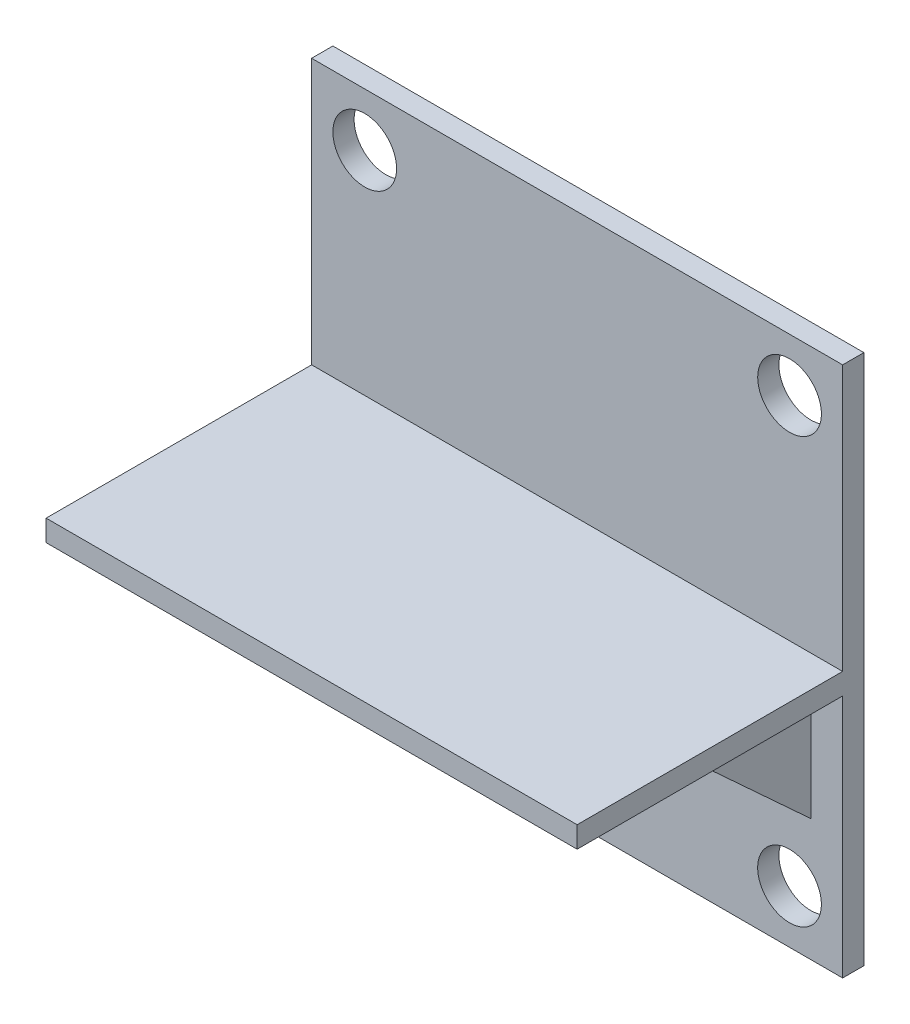
ISO-10303-21;
HEADER;
FILE_DESCRIPTION(('STEP AP214'),'2;1');
FILE_NAME('part.step','',(''),(''),'','','');
FILE_SCHEMA(('AUTOMOTIVE_DESIGN { 1 0 10303 214 1 1 1 1 }'));
ENDSEC;
DATA;
#1=APPLICATION_CONTEXT('core data for automotive mechanical design processes');
#2=APPLICATION_PROTOCOL_DEFINITION('international standard','automotive_design',2000,#1);
#3=PRODUCT_CONTEXT('',#1,'mechanical');
#4=PRODUCT('Part','Part','',(#3));
#5=PRODUCT_RELATED_PRODUCT_CATEGORY('part','',(#4));
#6=PRODUCT_DEFINITION_FORMATION('','',#4);
#7=PRODUCT_DEFINITION_CONTEXT('part definition',#1,'design');
#8=PRODUCT_DEFINITION('design','',#6,#7);
#9=PRODUCT_DEFINITION_SHAPE('','',#8);
#10=(LENGTH_UNIT() NAMED_UNIT(*) SI_UNIT(.MILLI.,.METRE.));
#11=(NAMED_UNIT(*) PLANE_ANGLE_UNIT() SI_UNIT($,.RADIAN.));
#12=(NAMED_UNIT(*) SI_UNIT($,.STERADIAN.) SOLID_ANGLE_UNIT());
#13=UNCERTAINTY_MEASURE_WITH_UNIT(LENGTH_MEASURE(1.E-05),#10,'distance_accuracy_value','');
#14=(GEOMETRIC_REPRESENTATION_CONTEXT(3) GLOBAL_UNCERTAINTY_ASSIGNED_CONTEXT((#13)) GLOBAL_UNIT_ASSIGNED_CONTEXT((#10,
#11,#12)) REPRESENTATION_CONTEXT('',''));
#15=CARTESIAN_POINT('',(0.,0.,0.));
#16=DIRECTION('',(0.,0.,1.));
#17=DIRECTION('',(1.,0.,0.));
#18=AXIS2_PLACEMENT_3D('',#15,#16,#17);
#19=CARTESIAN_POINT('',(0.,0.,10.));
#20=DIRECTION('',(0.,0.,1.));
#21=DIRECTION('',(1.,0.,0.));
#22=AXIS2_PLACEMENT_3D('',#19,#20,#21);
#23=PLANE('',#22);
#24=CARTESIAN_POINT('',(-71.100042531515,-124.872643547367,10.));
#25=DIRECTION('',(0.,0.,1.));
#26=DIRECTION('',(-1.,0.,0.));
#27=AXIS2_PLACEMENT_3D('',#24,#25,#26);
#28=CIRCLE('',#27,15.);
#29=CARTESIAN_POINT('',(-86.100042531515,-124.872643547367,10.));
#30=VERTEX_POINT('',#29);
#31=EDGE_CURVE('E196',#30,#30,#28,.T.);
#32=ORIENTED_EDGE('',*,*,#31,.F.);
#33=EDGE_LOOP('',(#32));
#34=FACE_BOUND('',#33,.T.);
#35=CARTESIAN_POINT('',(128.899957468485,-124.872643547367,10.));
#36=DIRECTION('',(0.,0.,1.));
#37=DIRECTION('',(1.,0.,0.));
#38=AXIS2_PLACEMENT_3D('',#35,#36,#37);
#39=CIRCLE('',#38,15.);
#40=CARTESIAN_POINT('',(143.899957468485,-124.872643547367,10.));
#41=VERTEX_POINT('',#40);
#42=EDGE_CURVE('E205',#41,#41,#39,.T.);
#43=ORIENTED_EDGE('',*,*,#42,.F.);
#44=EDGE_LOOP('',(#43));
#45=FACE_BOUND('',#44,.T.);
#46=DIRECTION('',(-1.,0.,0.));
#47=VECTOR('',#46,1.);
#48=CARTESIAN_POINT('',(153.899957468485,-34.8726435473666,10.));
#49=LINE('',#48,#47);
#50=CARTESIAN_POINT('',(128.899957468485,-34.8726435473666,10.));
#51=VERTEX_POINT('',#50);
#52=CARTESIAN_POINT('',(38.899957468485,-34.8726435473666,10.));
#53=VERTEX_POINT('',#52);
#54=EDGE_CURVE('E189',#51,#53,#49,.T.);
#55=ORIENTED_EDGE('',*,*,#54,.T.);
#56=DIRECTION('',(0.,-1.,0.));
#57=VECTOR('',#56,1.);
#58=CARTESIAN_POINT('',(38.899957468485,0.,10.));
#59=LINE('',#58,#57);
#60=CARTESIAN_POINT('',(38.899957468485,-95.8832277083029,10.));
#61=VERTEX_POINT('',#60);
#62=EDGE_CURVE('E482',#53,#61,#59,.T.);
#63=ORIENTED_EDGE('',*,*,#62,.T.);
#64=DIRECTION('',(-1.,0.,0.));
#65=VECTOR('',#64,1.);
#66=CARTESIAN_POINT('',(38.899957468485,-95.8832277083029,10.));
#67=LINE('',#66,#65);
#68=CARTESIAN_POINT('',(18.899957468485,-95.8832277083029,10.));
#69=VERTEX_POINT('',#68);
#70=EDGE_CURVE('E181',#61,#69,#67,.T.);
#71=ORIENTED_EDGE('',*,*,#70,.T.);
#72=DIRECTION('',(0.,-1.,0.));
#73=VECTOR('',#72,1.);
#74=CARTESIAN_POINT('',(18.899957468485,0.,10.));
#75=LINE('',#74,#73);
#76=CARTESIAN_POINT('',(18.899957468485,-34.8726435473666,10.));
#77=VERTEX_POINT('',#76);
#78=EDGE_CURVE('E170',#77,#69,#75,.T.);
#79=ORIENTED_EDGE('',*,*,#78,.F.);
#80=CARTESIAN_POINT('',(-71.100042531515,-34.8726435473666,10.));
#81=VERTEX_POINT('',#80);
#82=EDGE_CURVE('E178',#77,#81,#49,.T.);
#83=ORIENTED_EDGE('',*,*,#82,.T.);
#84=DIRECTION('',(0.,-1.,0.));
#85=VECTOR('',#84,1.);
#86=CARTESIAN_POINT('',(-71.100042531515,-92.3726435473666,10.));
#87=LINE('',#86,#85);
#88=CARTESIAN_POINT('',(-71.100042531515,-92.3726435473666,10.));
#89=VERTEX_POINT('',#88);
#90=EDGE_CURVE('E323',#81,#89,#87,.T.);
#91=ORIENTED_EDGE('',*,*,#90,.T.);
#92=DIRECTION('',(1.,0.,0.));
#93=VECTOR('',#92,1.);
#94=CARTESIAN_POINT('',(-81.100042531515,-92.3726435473666,10.));
#95=LINE('',#94,#93);
#96=CARTESIAN_POINT('',(-81.100042531515,-92.3726435473666,10.));
#97=VERTEX_POINT('',#96);
#98=EDGE_CURVE('E305',#97,#89,#95,.T.);
#99=ORIENTED_EDGE('',*,*,#98,.F.);
#100=DIRECTION('',(0.,-1.,0.));
#101=VECTOR('',#100,1.);
#102=CARTESIAN_POINT('',(-81.100042531515,-92.3726435473666,10.));
#103=LINE('',#102,#101);
#104=CARTESIAN_POINT('',(-81.100042531515,-34.8726435473666,10.));
#105=VERTEX_POINT('',#104);
#106=EDGE_CURVE('E310',#105,#97,#103,.T.);
#107=ORIENTED_EDGE('',*,*,#106,.F.);
#108=CARTESIAN_POINT('',(-96.100042531515,-34.8726435473666,10.));
#109=VERTEX_POINT('',#108);
#110=EDGE_CURVE('E190',#105,#109,#49,.T.);
#111=ORIENTED_EDGE('',*,*,#110,.T.);
#112=DIRECTION('',(0.,-1.,0.));
#113=VECTOR('',#112,1.);
#114=CARTESIAN_POINT('',(-96.100042531515,100.127356452633,10.));
#115=LINE('',#114,#113);
#116=CARTESIAN_POINT('',(-96.100042531515,-149.872643547367,10.));
#117=VERTEX_POINT('',#116);
#118=EDGE_CURVE('E230',#109,#117,#115,.T.);
#119=ORIENTED_EDGE('',*,*,#118,.T.);
#120=DIRECTION('',(1.,0.,0.));
#121=VECTOR('',#120,1.);
#122=CARTESIAN_POINT('',(-96.100042531515,-149.872643547367,10.));
#123=LINE('',#122,#121);
#124=CARTESIAN_POINT('',(153.899957468485,-149.872643547367,10.));
#125=VERTEX_POINT('',#124);
#126=EDGE_CURVE('E235',#117,#125,#123,.T.);
#127=ORIENTED_EDGE('',*,*,#126,.T.);
#128=DIRECTION('',(0.,1.,0.));
#129=VECTOR('',#128,1.);
#130=CARTESIAN_POINT('',(153.899957468485,-149.872643547367,10.));
#131=LINE('',#130,#129);
#132=CARTESIAN_POINT('',(153.899957468485,-34.8726435473666,10.));
#133=VERTEX_POINT('',#132);
#134=EDGE_CURVE('E238',#125,#133,#131,.T.);
#135=ORIENTED_EDGE('',*,*,#134,.T.);
#136=CARTESIAN_POINT('',(138.899957468485,-34.8726435473666,10.));
#137=VERTEX_POINT('',#136);
#138=EDGE_CURVE('E192',#133,#137,#49,.T.);
#139=ORIENTED_EDGE('',*,*,#138,.T.);
#140=DIRECTION('',(0.,-1.,0.));
#141=VECTOR('',#140,1.);
#142=CARTESIAN_POINT('',(138.899957468485,-92.3726435473666,10.));
#143=LINE('',#142,#141);
#144=CARTESIAN_POINT('',(138.899957468485,-92.3726435473666,10.));
#145=VERTEX_POINT('',#144);
#146=EDGE_CURVE('E58',#137,#145,#143,.T.);
#147=ORIENTED_EDGE('',*,*,#146,.T.);
#148=DIRECTION('',(-1.,0.,0.));
#149=VECTOR('',#148,1.);
#150=CARTESIAN_POINT('',(138.899957468485,-92.3726435473666,10.));
#151=LINE('',#150,#149);
#152=CARTESIAN_POINT('',(128.899957468485,-92.3726435473666,10.));
#153=VERTEX_POINT('',#152);
#154=EDGE_CURVE('E466',#145,#153,#151,.T.);
#155=ORIENTED_EDGE('',*,*,#154,.T.);
#156=DIRECTION('',(0.,-1.,0.));
#157=VECTOR('',#156,1.);
#158=CARTESIAN_POINT('',(128.899957468485,-92.3726435473666,10.));
#159=LINE('',#158,#157);
#160=EDGE_CURVE('E453',#51,#153,#159,.T.);
#161=ORIENTED_EDGE('',*,*,#160,.F.);
#162=EDGE_LOOP('',(#55,#63,#71,#79,#83,#91,#99,#107,#111,#119,#127,#135,#139,#147,#155,#161));
#163=FACE_BOUND('',#162,.T.);
#164=ADVANCED_FACE('F35',(#34,#45,#163),#23,.T.);
#165=CARTESIAN_POINT('',(153.899957468485,-34.8726435473666,0.));
#166=DIRECTION('',(0.,1.,0.));
#167=DIRECTION('',(0.,0.,1.));
#168=AXIS2_PLACEMENT_3D('',#165,#166,#167);
#169=PLANE('',#168);
#170=DIRECTION('',(0.,0.,-1.));
#171=VECTOR('',#170,1.);
#172=CARTESIAN_POINT('',(38.899957468485,-34.8726435473666,0.));
#173=LINE('',#172,#171);
#174=CARTESIAN_POINT('',(38.899957468485,-34.8726435473666,75.6202001749308));
#175=VERTEX_POINT('',#174);
#176=EDGE_CURVE('E484',#175,#53,#173,.T.);
#177=ORIENTED_EDGE('',*,*,#176,.T.);
#178=ORIENTED_EDGE('',*,*,#54,.F.);
#179=DIRECTION('',(0.,0.,-1.));
#180=VECTOR('',#179,1.);
#181=CARTESIAN_POINT('',(128.899957468485,-34.8726435473666,10.));
#182=LINE('',#181,#180);
#183=CARTESIAN_POINT('',(128.899957468485,-34.8726435473666,72.5));
#184=VERTEX_POINT('',#183);
#185=EDGE_CURVE('E451',#184,#51,#182,.T.);
#186=ORIENTED_EDGE('',*,*,#185,.F.);
#187=DIRECTION('',(-1.,0.,0.));
#188=VECTOR('',#187,1.);
#189=CARTESIAN_POINT('',(138.899957468485,-34.8726435473666,72.5));
#190=LINE('',#189,#188);
#191=CARTESIAN_POINT('',(138.899957468485,-34.8726435473666,72.5));
#192=VERTEX_POINT('',#191);
#193=EDGE_CURVE('E326',#192,#184,#190,.T.);
#194=ORIENTED_EDGE('',*,*,#193,.F.);
#195=DIRECTION('',(0.,0.,-1.));
#196=VECTOR('',#195,1.);
#197=CARTESIAN_POINT('',(138.899957468485,-34.8726435473666,10.));
#198=LINE('',#197,#196);
#199=EDGE_CURVE('E465',#192,#137,#198,.T.);
#200=ORIENTED_EDGE('',*,*,#199,.T.);
#201=ORIENTED_EDGE('',*,*,#138,.F.);
#202=DIRECTION('',(0.,0.,-1.));
#203=VECTOR('',#202,1.);
#204=CARTESIAN_POINT('',(153.899957468485,-34.8726435473666,0.));
#205=LINE('',#204,#203);
#206=CARTESIAN_POINT('',(153.899957468485,-34.8726435473666,135.));
#207=VERTEX_POINT('',#206);
#208=EDGE_CURVE('E296',#207,#133,#205,.T.);
#209=ORIENTED_EDGE('',*,*,#208,.F.);
#210=DIRECTION('',(-1.,0.,0.));
#211=VECTOR('',#210,1.);
#212=CARTESIAN_POINT('',(153.899957468485,-34.8726435473666,135.));
#213=LINE('',#212,#211);
#214=CARTESIAN_POINT('',(-96.100042531515,-34.8726435473666,135.));
#215=VERTEX_POINT('',#214);
#216=EDGE_CURVE('E283',#207,#215,#213,.T.);
#217=ORIENTED_EDGE('',*,*,#216,.T.);
#218=DIRECTION('',(0.,0.,-1.));
#219=VECTOR('',#218,1.);
#220=CARTESIAN_POINT('',(-96.100042531515,-34.8726435473666,0.));
#221=LINE('',#220,#219);
#222=EDGE_CURVE('E301',#215,#109,#221,.T.);
#223=ORIENTED_EDGE('',*,*,#222,.T.);
#224=ORIENTED_EDGE('',*,*,#110,.F.);
#225=DIRECTION('',(0.,0.,-1.));
#226=VECTOR('',#225,1.);
#227=CARTESIAN_POINT('',(-81.100042531515,-34.8726435473666,10.));
#228=LINE('',#227,#226);
#229=CARTESIAN_POINT('',(-81.100042531515,-34.8726435473666,72.5));
#230=VERTEX_POINT('',#229);
#231=EDGE_CURVE('E312',#230,#105,#228,.T.);
#232=ORIENTED_EDGE('',*,*,#231,.F.);
#233=DIRECTION('',(1.,0.,0.));
#234=VECTOR('',#233,1.);
#235=CARTESIAN_POINT('',(-81.100042531515,-34.8726435473666,72.5));
#236=LINE('',#235,#234);
#237=CARTESIAN_POINT('',(-71.100042531515,-34.8726435473666,72.5));
#238=VERTEX_POINT('',#237);
#239=EDGE_CURVE('E330',#230,#238,#236,.T.);
#240=ORIENTED_EDGE('',*,*,#239,.T.);
#241=DIRECTION('',(0.,0.,-1.));
#242=VECTOR('',#241,1.);
#243=CARTESIAN_POINT('',(-71.100042531515,-34.8726435473666,10.));
#244=LINE('',#243,#242);
#245=EDGE_CURVE('E187',#238,#81,#244,.T.);
#246=ORIENTED_EDGE('',*,*,#245,.T.);
#247=ORIENTED_EDGE('',*,*,#82,.F.);
#248=DIRECTION('',(0.,0.,-1.));
#249=VECTOR('',#248,1.);
#250=CARTESIAN_POINT('',(18.899957468485,-34.8726435473666,0.));
#251=LINE('',#250,#249);
#252=CARTESIAN_POINT('',(18.899957468485,-34.8726435473666,75.6202001749308));
#253=VERTEX_POINT('',#252);
#254=EDGE_CURVE('E166',#253,#77,#251,.T.);
#255=ORIENTED_EDGE('',*,*,#254,.F.);
#256=DIRECTION('',(-1.,0.,0.));
#257=VECTOR('',#256,1.);
#258=CARTESIAN_POINT('',(38.899957468485,-34.8726435473666,75.6202001749308));
#259=LINE('',#258,#257);
#260=EDGE_CURVE('E472',#175,#253,#259,.T.);
#261=ORIENTED_EDGE('',*,*,#260,.F.);
#262=EDGE_LOOP('',(#177,#178,#186,#194,#200,#201,#209,#217,#223,#224,#232,#240,#246,#247,#255,#261));
#263=FACE_BOUND('',#262,.T.);
#264=ADVANCED_FACE('F185',(#263),#169,.F.);
#265=CARTESIAN_POINT('',(153.899957468485,100.127356452633,10.));
#266=DIRECTION('',(0.,-1.,0.));
#267=DIRECTION('',(0.,0.,-1.));
#268=AXIS2_PLACEMENT_3D('',#265,#266,#267);
#269=PLANE('',#268);
#270=DIRECTION('',(-1.,0.,0.));
#271=VECTOR('',#270,1.);
#272=CARTESIAN_POINT('',(153.899957468485,100.127356452633,0.));
#273=LINE('',#272,#271);
#274=CARTESIAN_POINT('',(153.899957468485,100.127356452633,0.));
#275=VERTEX_POINT('',#274);
#276=CARTESIAN_POINT('',(-96.100042531515,100.127356452633,0.));
#277=VERTEX_POINT('',#276);
#278=EDGE_CURVE('E224',#275,#277,#273,.T.);
#279=ORIENTED_EDGE('',*,*,#278,.T.);
#280=DIRECTION('',(0.,0.,-1.));
#281=VECTOR('',#280,1.);
#282=CARTESIAN_POINT('',(-96.100042531515,100.127356452633,10.));
#283=LINE('',#282,#281);
#284=CARTESIAN_POINT('',(-96.100042531515,100.127356452633,10.));
#285=VERTEX_POINT('',#284);
#286=EDGE_CURVE('E11',#285,#277,#283,.T.);
#287=ORIENTED_EDGE('',*,*,#286,.F.);
#288=DIRECTION('',(-1.,0.,0.));
#289=VECTOR('',#288,1.);
#290=CARTESIAN_POINT('',(153.899957468485,100.127356452633,10.));
#291=LINE('',#290,#289);
#292=CARTESIAN_POINT('',(153.899957468485,100.127356452633,10.));
#293=VERTEX_POINT('',#292);
#294=EDGE_CURVE('E227',#293,#285,#291,.T.);
#295=ORIENTED_EDGE('',*,*,#294,.F.);
#296=DIRECTION('',(0.,0.,-1.));
#297=VECTOR('',#296,1.);
#298=CARTESIAN_POINT('',(153.899957468485,100.127356452633,10.));
#299=LINE('',#298,#297);
#300=EDGE_CURVE('E240',#293,#275,#299,.T.);
#301=ORIENTED_EDGE('',*,*,#300,.T.);
#302=EDGE_LOOP('',(#279,#287,#295,#301));
#303=FACE_BOUND('',#302,.T.);
#304=ADVANCED_FACE('F37',(#303),#269,.F.);
#305=CARTESIAN_POINT('',(-96.100042531515,100.127356452633,10.));
#306=DIRECTION('',(1.,0.,0.));
#307=DIRECTION('',(0.,0.,-1.));
#308=AXIS2_PLACEMENT_3D('',#305,#306,#307);
#309=PLANE('',#308);
#310=DIRECTION('',(0.,-1.,0.));
#311=VECTOR('',#310,1.);
#312=CARTESIAN_POINT('',(-96.100042531515,100.127356452633,0.));
#313=LINE('',#312,#311);
#314=CARTESIAN_POINT('',(-96.100042531515,-149.872643547367,0.));
#315=VERTEX_POINT('',#314);
#316=EDGE_CURVE('E243',#277,#315,#313,.T.);
#317=ORIENTED_EDGE('',*,*,#316,.T.);
#318=DIRECTION('',(0.,0.,-1.));
#319=VECTOR('',#318,1.);
#320=CARTESIAN_POINT('',(-96.100042531515,-149.872643547367,10.));
#321=LINE('',#320,#319);
#322=EDGE_CURVE('E43',#117,#315,#321,.T.);
#323=ORIENTED_EDGE('',*,*,#322,.F.);
#324=ORIENTED_EDGE('',*,*,#118,.F.);
#325=ORIENTED_EDGE('',*,*,#222,.F.);
#326=DIRECTION('',(0.,-1.,0.));
#327=VECTOR('',#326,1.);
#328=CARTESIAN_POINT('',(-96.100042531515,0.,135.));
#329=LINE('',#328,#327);
#330=CARTESIAN_POINT('',(-96.100042531515,-24.8726435473666,135.));
#331=VERTEX_POINT('',#330);
#332=EDGE_CURVE('E304',#331,#215,#329,.T.);
#333=ORIENTED_EDGE('',*,*,#332,.F.);
#334=DIRECTION('',(0.,0.,1.));
#335=VECTOR('',#334,1.);
#336=CARTESIAN_POINT('',(-96.100042531515,-24.8726435473666,0.));
#337=LINE('',#336,#335);
#338=CARTESIAN_POINT('',(-96.100042531515,-24.8726435473666,10.));
#339=VERTEX_POINT('',#338);
#340=EDGE_CURVE('E289',#339,#331,#337,.T.);
#341=ORIENTED_EDGE('',*,*,#340,.F.);
#342=EDGE_CURVE('E232',#285,#339,#115,.T.);
#343=ORIENTED_EDGE('',*,*,#342,.F.);
#344=ORIENTED_EDGE('',*,*,#286,.T.);
#345=EDGE_LOOP('',(#317,#323,#324,#325,#333,#341,#343,#344));
#346=FACE_BOUND('',#345,.T.);
#347=ADVANCED_FACE('F308',(#346),#309,.F.);
#348=CARTESIAN_POINT('',(-96.100042531515,-149.872643547367,10.));
#349=DIRECTION('',(0.,1.,0.));
#350=DIRECTION('',(0.,0.,1.));
#351=AXIS2_PLACEMENT_3D('',#348,#349,#350);
#352=PLANE('',#351);
#353=DIRECTION('',(1.,0.,0.));
#354=VECTOR('',#353,1.);
#355=CARTESIAN_POINT('',(-96.100042531515,-149.872643547367,0.));
#356=LINE('',#355,#354);
#357=CARTESIAN_POINT('',(153.899957468485,-149.872643547367,0.));
#358=VERTEX_POINT('',#357);
#359=EDGE_CURVE('E245',#315,#358,#356,.T.);
#360=ORIENTED_EDGE('',*,*,#359,.T.);
#361=DIRECTION('',(0.,0.,-1.));
#362=VECTOR('',#361,1.);
#363=CARTESIAN_POINT('',(153.899957468485,-149.872643547367,10.));
#364=LINE('',#363,#362);
#365=EDGE_CURVE('E250',#125,#358,#364,.T.);
#366=ORIENTED_EDGE('',*,*,#365,.F.);
#367=ORIENTED_EDGE('',*,*,#126,.F.);
#368=ORIENTED_EDGE('',*,*,#322,.T.);
#369=EDGE_LOOP('',(#360,#366,#367,#368));
#370=FACE_BOUND('',#369,.T.);
#371=ADVANCED_FACE('F257',(#370),#352,.F.);
#372=CARTESIAN_POINT('',(153.899957468485,-149.872643547367,10.));
#373=DIRECTION('',(-1.,0.,0.));
#374=DIRECTION('',(0.,0.,1.));
#375=AXIS2_PLACEMENT_3D('',#372,#373,#374);
#376=PLANE('',#375);
#377=DIRECTION('',(0.,1.,0.));
#378=VECTOR('',#377,1.);
#379=CARTESIAN_POINT('',(153.899957468485,-149.872643547367,0.));
#380=LINE('',#379,#378);
#381=EDGE_CURVE('E231',#358,#275,#380,.T.);
#382=ORIENTED_EDGE('',*,*,#381,.T.);
#383=ORIENTED_EDGE('',*,*,#300,.F.);
#384=CARTESIAN_POINT('',(153.899957468485,-24.8726435473666,10.));
#385=VERTEX_POINT('',#384);
#386=EDGE_CURVE('E237',#385,#293,#131,.T.);
#387=ORIENTED_EDGE('',*,*,#386,.F.);
#388=DIRECTION('',(0.,0.,1.));
#389=VECTOR('',#388,1.);
#390=CARTESIAN_POINT('',(153.899957468485,-24.8726435473666,0.));
#391=LINE('',#390,#389);
#392=CARTESIAN_POINT('',(153.899957468485,-24.8726435473666,135.));
#393=VERTEX_POINT('',#392);
#394=EDGE_CURVE('E277',#385,#393,#391,.T.);
#395=ORIENTED_EDGE('',*,*,#394,.T.);
#396=DIRECTION('',(0.,-1.,0.));
#397=VECTOR('',#396,1.);
#398=CARTESIAN_POINT('',(153.899957468485,0.,135.));
#399=LINE('',#398,#397);
#400=EDGE_CURVE('E280',#393,#207,#399,.T.);
#401=ORIENTED_EDGE('',*,*,#400,.T.);
#402=ORIENTED_EDGE('',*,*,#208,.T.);
#403=ORIENTED_EDGE('',*,*,#134,.F.);
#404=ORIENTED_EDGE('',*,*,#365,.T.);
#405=EDGE_LOOP('',(#382,#383,#387,#395,#401,#402,#403,#404));
#406=FACE_BOUND('',#405,.T.);
#407=ADVANCED_FACE('F267',(#406),#376,.F.);
#408=DIRECTION('',(-1.,0.,0.));
#409=VECTOR('',#408,1.);
#410=CARTESIAN_POINT('',(153.899957468485,-24.8726435473666,10.));
#411=LINE('',#410,#409);
#412=EDGE_CURVE('E193',#385,#339,#411,.T.);
#413=ORIENTED_EDGE('',*,*,#412,.F.);
#414=ORIENTED_EDGE('',*,*,#386,.T.);
#415=ORIENTED_EDGE('',*,*,#294,.T.);
#416=ORIENTED_EDGE('',*,*,#342,.T.);
#417=EDGE_LOOP('',(#413,#414,#415,#416));
#418=FACE_BOUND('',#417,.T.);
#419=CARTESIAN_POINT('',(-71.100042531515,75.1273564526334,10.));
#420=DIRECTION('',(0.,0.,1.));
#421=DIRECTION('',(1.,0.,0.));
#422=AXIS2_PLACEMENT_3D('',#419,#420,#421);
#423=CIRCLE('',#422,15.);
#424=CARTESIAN_POINT('',(-56.100042531515,75.1273564526334,10.));
#425=VERTEX_POINT('',#424);
#426=EDGE_CURVE('E213',#425,#425,#423,.T.);
#427=ORIENTED_EDGE('',*,*,#426,.F.);
#428=EDGE_LOOP('',(#427));
#429=FACE_BOUND('',#428,.T.);
#430=CARTESIAN_POINT('',(128.899957468485,75.1273564526334,10.));
#431=DIRECTION('',(0.,0.,1.));
#432=DIRECTION('',(-1.,0.,0.));
#433=AXIS2_PLACEMENT_3D('',#430,#431,#432);
#434=CIRCLE('',#433,15.);
#435=CARTESIAN_POINT('',(113.899957468485,75.1273564526334,10.));
#436=VERTEX_POINT('',#435);
#437=EDGE_CURVE('E212',#436,#436,#434,.T.);
#438=ORIENTED_EDGE('',*,*,#437,.F.);
#439=EDGE_LOOP('',(#438));
#440=FACE_BOUND('',#439,.T.);
#441=ADVANCED_FACE('F275',(#418,#429,#440),#23,.T.);
#442=CARTESIAN_POINT('',(0.,0.,0.));
#443=DIRECTION('',(0.,0.,1.));
#444=DIRECTION('',(1.,0.,0.));
#445=AXIS2_PLACEMENT_3D('',#442,#443,#444);
#446=PLANE('',#445);
#447=CARTESIAN_POINT('',(-71.100042531515,75.1273564526334,0.));
#448=DIRECTION('',(0.,0.,1.));
#449=DIRECTION('',(1.,0.,0.));
#450=AXIS2_PLACEMENT_3D('',#447,#448,#449);
#451=CIRCLE('',#450,15.);
#452=CARTESIAN_POINT('',(-56.100042531515,75.1273564526334,0.));
#453=VERTEX_POINT('',#452);
#454=EDGE_CURVE('E209',#453,#453,#451,.T.);
#455=ORIENTED_EDGE('',*,*,#454,.T.);
#456=EDGE_LOOP('',(#455));
#457=FACE_BOUND('',#456,.T.);
#458=CARTESIAN_POINT('',(128.899957468485,-124.872643547367,0.));
#459=DIRECTION('',(0.,0.,1.));
#460=DIRECTION('',(1.,0.,0.));
#461=AXIS2_PLACEMENT_3D('',#458,#459,#460);
#462=CIRCLE('',#461,15.);
#463=CARTESIAN_POINT('',(143.899957468485,-124.872643547367,0.));
#464=VERTEX_POINT('',#463);
#465=EDGE_CURVE('E216',#464,#464,#462,.T.);
#466=ORIENTED_EDGE('',*,*,#465,.T.);
#467=EDGE_LOOP('',(#466));
#468=FACE_BOUND('',#467,.T.);
#469=CARTESIAN_POINT('',(-71.100042531515,-124.872643547367,0.));
#470=DIRECTION('',(0.,0.,1.));
#471=DIRECTION('',(-1.,0.,0.));
#472=AXIS2_PLACEMENT_3D('',#469,#470,#471);
#473=CIRCLE('',#472,15.);
#474=CARTESIAN_POINT('',(-86.100042531515,-124.872643547367,0.));
#475=VERTEX_POINT('',#474);
#476=EDGE_CURVE('E200',#475,#475,#473,.T.);
#477=ORIENTED_EDGE('',*,*,#476,.T.);
#478=EDGE_LOOP('',(#477));
#479=FACE_BOUND('',#478,.T.);
#480=CARTESIAN_POINT('',(128.899957468485,75.1273564526334,0.));
#481=DIRECTION('',(0.,0.,1.));
#482=DIRECTION('',(-1.,0.,0.));
#483=AXIS2_PLACEMENT_3D('',#480,#481,#482);
#484=CIRCLE('',#483,15.);
#485=CARTESIAN_POINT('',(113.899957468485,75.1273564526334,0.));
#486=VERTEX_POINT('',#485);
#487=EDGE_CURVE('E221',#486,#486,#484,.T.);
#488=ORIENTED_EDGE('',*,*,#487,.T.);
#489=EDGE_LOOP('',(#488));
#490=FACE_BOUND('',#489,.T.);
#491=ORIENTED_EDGE('',*,*,#278,.F.);
#492=ORIENTED_EDGE('',*,*,#381,.F.);
#493=ORIENTED_EDGE('',*,*,#359,.F.);
#494=ORIENTED_EDGE('',*,*,#316,.F.);
#495=EDGE_LOOP('',(#491,#492,#493,#494));
#496=FACE_BOUND('',#495,.T.);
#497=ADVANCED_FACE('F264',(#457,#468,#479,#490,#496),#446,.F.);
#498=CARTESIAN_POINT('',(128.899957468485,75.1273564526334,0.));
#499=DIRECTION('',(0.,0.,1.));
#500=DIRECTION('',(1.,0.,0.));
#501=AXIS2_PLACEMENT_3D('',#498,#499,#500);
#502=CYLINDRICAL_SURFACE('',#501,15.);
#503=ORIENTED_EDGE('',*,*,#487,.F.);
#504=EDGE_LOOP('',(#503));
#505=FACE_BOUND('',#504,.T.);
#506=ORIENTED_EDGE('',*,*,#437,.T.);
#507=EDGE_LOOP('',(#506));
#508=FACE_BOUND('',#507,.T.);
#509=ADVANCED_FACE('F366',(#505,#508),#502,.F.);
#510=CARTESIAN_POINT('',(-71.100042531515,-124.872643547367,0.));
#511=DIRECTION('',(0.,0.,1.));
#512=DIRECTION('',(1.,0.,0.));
#513=AXIS2_PLACEMENT_3D('',#510,#511,#512);
#514=CYLINDRICAL_SURFACE('',#513,15.);
#515=ORIENTED_EDGE('',*,*,#476,.F.);
#516=EDGE_LOOP('',(#515));
#517=FACE_BOUND('',#516,.T.);
#518=ORIENTED_EDGE('',*,*,#31,.T.);
#519=EDGE_LOOP('',(#518));
#520=FACE_BOUND('',#519,.T.);
#521=ADVANCED_FACE('F572',(#517,#520),#514,.F.);
#522=CARTESIAN_POINT('',(128.899957468485,-124.872643547367,0.));
#523=DIRECTION('',(0.,0.,1.));
#524=DIRECTION('',(1.,0.,0.));
#525=AXIS2_PLACEMENT_3D('',#522,#523,#524);
#526=CYLINDRICAL_SURFACE('',#525,15.);
#527=ORIENTED_EDGE('',*,*,#465,.F.);
#528=EDGE_LOOP('',(#527));
#529=FACE_BOUND('',#528,.T.);
#530=ORIENTED_EDGE('',*,*,#42,.T.);
#531=EDGE_LOOP('',(#530));
#532=FACE_BOUND('',#531,.T.);
#533=ADVANCED_FACE('F562',(#529,#532),#526,.F.);
#534=CARTESIAN_POINT('',(-71.100042531515,75.1273564526334,0.));
#535=DIRECTION('',(0.,0.,1.));
#536=DIRECTION('',(1.,0.,0.));
#537=AXIS2_PLACEMENT_3D('',#534,#535,#536);
#538=CYLINDRICAL_SURFACE('',#537,15.);
#539=ORIENTED_EDGE('',*,*,#454,.F.);
#540=EDGE_LOOP('',(#539));
#541=FACE_BOUND('',#540,.T.);
#542=ORIENTED_EDGE('',*,*,#426,.T.);
#543=EDGE_LOOP('',(#542));
#544=FACE_BOUND('',#543,.T.);
#545=ADVANCED_FACE('F537',(#541,#544),#538,.F.);
#546=CARTESIAN_POINT('',(153.899957468485,-24.8726435473666,0.));
#547=DIRECTION('',(0.,-1.,0.));
#548=DIRECTION('',(0.,0.,-1.));
#549=AXIS2_PLACEMENT_3D('',#546,#547,#548);
#550=PLANE('',#549);
#551=ORIENTED_EDGE('',*,*,#340,.T.);
#552=DIRECTION('',(-1.,0.,0.));
#553=VECTOR('',#552,1.);
#554=CARTESIAN_POINT('',(153.899957468485,-24.8726435473666,135.));
#555=LINE('',#554,#553);
#556=EDGE_CURVE('E286',#393,#331,#555,.T.);
#557=ORIENTED_EDGE('',*,*,#556,.F.);
#558=ORIENTED_EDGE('',*,*,#394,.F.);
#559=ORIENTED_EDGE('',*,*,#412,.T.);
#560=EDGE_LOOP('',(#551,#557,#558,#559));
#561=FACE_BOUND('',#560,.T.);
#562=ADVANCED_FACE('F287',(#561),#550,.F.);
#563=CARTESIAN_POINT('',(153.899957468485,0.,135.));
#564=DIRECTION('',(0.,0.,-1.));
#565=DIRECTION('',(-1.,0.,0.));
#566=AXIS2_PLACEMENT_3D('',#563,#564,#565);
#567=PLANE('',#566);
#568=ORIENTED_EDGE('',*,*,#332,.T.);
#569=ORIENTED_EDGE('',*,*,#216,.F.);
#570=ORIENTED_EDGE('',*,*,#400,.F.);
#571=ORIENTED_EDGE('',*,*,#556,.T.);
#572=EDGE_LOOP('',(#568,#569,#570,#571));
#573=FACE_BOUND('',#572,.T.);
#574=ADVANCED_FACE('F293',(#573),#567,.F.);
#575=CARTESIAN_POINT('',(-81.100042531515,-34.8726435473666,72.5));
#576=DIRECTION('',(0.,0.73593101176183,-0.677056530820883));
#577=DIRECTION('',(0.,0.677056530820883,0.73593101176183));
#578=AXIS2_PLACEMENT_3D('',#575,#576,#577);
#579=PLANE('',#578);
#580=DIRECTION('',(0.,0.677056530820883,0.73593101176183));
#581=VECTOR('',#580,1.);
#582=CARTESIAN_POINT('',(-71.100042531515,-34.8726435473666,72.5));
#583=LINE('',#582,#581);
#584=EDGE_CURVE('E319',#89,#238,#583,.T.);
#585=ORIENTED_EDGE('',*,*,#584,.T.);
#586=ORIENTED_EDGE('',*,*,#239,.F.);
#587=DIRECTION('',(0.,0.677056530820883,0.73593101176183));
#588=VECTOR('',#587,1.);
#589=CARTESIAN_POINT('',(-81.100042531515,-34.8726435473666,72.5));
#590=LINE('',#589,#588);
#591=EDGE_CURVE('E317',#97,#230,#590,.T.);
#592=ORIENTED_EDGE('',*,*,#591,.F.);
#593=ORIENTED_EDGE('',*,*,#98,.T.);
#594=EDGE_LOOP('',(#585,#586,#592,#593));
#595=FACE_BOUND('',#594,.T.);
#596=ADVANCED_FACE('F336',(#595),#579,.F.);
#597=CARTESIAN_POINT('',(-81.100042531515,0.,0.));
#598=DIRECTION('',(-1.,0.,0.));
#599=DIRECTION('',(0.,0.,1.));
#600=AXIS2_PLACEMENT_3D('',#597,#598,#599);
#601=PLANE('',#600);
#602=ORIENTED_EDGE('',*,*,#231,.T.);
#603=ORIENTED_EDGE('',*,*,#106,.T.);
#604=ORIENTED_EDGE('',*,*,#591,.T.);
#605=EDGE_LOOP('',(#602,#603,#604));
#606=FACE_BOUND('',#605,.T.);
#607=ADVANCED_FACE('F315',(#606),#601,.T.);
#608=CARTESIAN_POINT('',(-71.100042531515,0.,0.));
#609=DIRECTION('',(-1.,0.,0.));
#610=DIRECTION('',(0.,0.,1.));
#611=AXIS2_PLACEMENT_3D('',#608,#609,#610);
#612=PLANE('',#611);
#613=ORIENTED_EDGE('',*,*,#245,.F.);
#614=ORIENTED_EDGE('',*,*,#584,.F.);
#615=ORIENTED_EDGE('',*,*,#90,.F.);
#616=EDGE_LOOP('',(#613,#614,#615));
#617=FACE_BOUND('',#616,.T.);
#618=ADVANCED_FACE('F338',(#617),#612,.F.);
#619=CARTESIAN_POINT('',(138.899957468485,-34.8726435473666,72.5));
#620=DIRECTION('',(0.,-0.73593101176183,0.677056530820883));
#621=DIRECTION('',(0.,-0.677056530820883,-0.73593101176183));
#622=AXIS2_PLACEMENT_3D('',#619,#620,#621);
#623=PLANE('',#622);
#624=DIRECTION('',(0.,0.677056530820883,0.73593101176183));
#625=VECTOR('',#624,1.);
#626=CARTESIAN_POINT('',(128.899957468485,-34.8726435473666,72.5));
#627=LINE('',#626,#625);
#628=EDGE_CURVE('E455',#153,#184,#627,.T.);
#629=ORIENTED_EDGE('',*,*,#628,.F.);
#630=ORIENTED_EDGE('',*,*,#154,.F.);
#631=DIRECTION('',(0.,0.677056530820883,0.73593101176183));
#632=VECTOR('',#631,1.);
#633=CARTESIAN_POINT('',(138.899957468485,-34.8726435473666,72.5));
#634=LINE('',#633,#632);
#635=EDGE_CURVE('E467',#145,#192,#634,.T.);
#636=ORIENTED_EDGE('',*,*,#635,.T.);
#637=ORIENTED_EDGE('',*,*,#193,.T.);
#638=EDGE_LOOP('',(#629,#630,#636,#637));
#639=FACE_BOUND('',#638,.T.);
#640=ADVANCED_FACE('F340',(#639),#623,.T.);
#641=CARTESIAN_POINT('',(138.899957468485,0.,0.));
#642=DIRECTION('',(1.,0.,0.));
#643=DIRECTION('',(0.,0.,1.));
#644=AXIS2_PLACEMENT_3D('',#641,#642,#643);
#645=PLANE('',#644);
#646=ORIENTED_EDGE('',*,*,#199,.F.);
#647=ORIENTED_EDGE('',*,*,#635,.F.);
#648=ORIENTED_EDGE('',*,*,#146,.F.);
#649=EDGE_LOOP('',(#646,#647,#648));
#650=FACE_BOUND('',#649,.T.);
#651=ADVANCED_FACE('F346',(#650),#645,.T.);
#652=CARTESIAN_POINT('',(128.899957468485,0.,0.));
#653=DIRECTION('',(1.,0.,0.));
#654=DIRECTION('',(0.,0.,1.));
#655=AXIS2_PLACEMENT_3D('',#652,#653,#654);
#656=PLANE('',#655);
#657=ORIENTED_EDGE('',*,*,#185,.T.);
#658=ORIENTED_EDGE('',*,*,#160,.T.);
#659=ORIENTED_EDGE('',*,*,#628,.T.);
#660=EDGE_LOOP('',(#657,#658,#659));
#661=FACE_BOUND('',#660,.T.);
#662=ADVANCED_FACE('F399',(#661),#656,.F.);
#663=CARTESIAN_POINT('',(38.899957468485,-42.8726435473666,75.6202001749308));
#664=DIRECTION('',(-1.,0.,0.));
#665=DIRECTION('',(0.,0.,1.));
#666=AXIS2_PLACEMENT_3D('',#663,#664,#665);
#667=CYLINDRICAL_SURFACE('',#666,8.);
#668=ORIENTED_EDGE('',*,*,#260,.T.);
#669=CARTESIAN_POINT('',(18.899957468485,-42.8726435473666,75.6202001749308));
#670=DIRECTION('',(-1.,0.,0.));
#671=DIRECTION('',(0.,0.,1.));
#672=AXIS2_PLACEMENT_3D('',#669,#670,#671);
#673=CIRCLE('',#672,8.);
#674=CARTESIAN_POINT('',(18.899957468485,-36.985195453272,70.2037479283637));
#675=VERTEX_POINT('',#674);
#676=EDGE_CURVE('E50',#253,#675,#673,.T.);
#677=ORIENTED_EDGE('',*,*,#676,.T.);
#678=DIRECTION('',(-1.,0.,0.));
#679=VECTOR('',#678,1.);
#680=CARTESIAN_POINT('',(38.899957468485,-36.985195453272,70.2037479283637));
#681=LINE('',#680,#679);
#682=CARTESIAN_POINT('',(38.899957468485,-36.985195453272,70.2037479283637));
#683=VERTEX_POINT('',#682);
#684=EDGE_CURVE('E457',#683,#675,#681,.T.);
#685=ORIENTED_EDGE('',*,*,#684,.F.);
#686=CARTESIAN_POINT('',(38.899957468485,-42.8726435473666,75.6202001749308));
#687=DIRECTION('',(-1.,0.,0.));
#688=DIRECTION('',(0.,0.,1.));
#689=AXIS2_PLACEMENT_3D('',#686,#687,#688);
#690=CIRCLE('',#689,8.);
#691=EDGE_CURVE('E486',#175,#683,#690,.T.);
#692=ORIENTED_EDGE('',*,*,#691,.F.);
#693=EDGE_LOOP('',(#668,#677,#685,#692));
#694=FACE_BOUND('',#693,.T.);
#695=ADVANCED_FACE('F393',(#694),#667,.F.);
#696=CARTESIAN_POINT('',(38.899957468485,-55.0111804307661,50.6102859963048));
#697=DIRECTION('',(0.,-0.73593101176183,0.677056530820883));
#698=DIRECTION('',(0.,-0.677056530820883,-0.73593101176183));
#699=AXIS2_PLACEMENT_3D('',#696,#697,#698);
#700=PLANE('',#699);
#701=ORIENTED_EDGE('',*,*,#684,.T.);
#702=DIRECTION('',(0.,0.677056530820883,0.73593101176183));
#703=VECTOR('',#702,1.);
#704=CARTESIAN_POINT('',(18.899957468485,-55.0111804307661,50.6102859963048));
#705=LINE('',#704,#703);
#706=CARTESIAN_POINT('',(18.899957468485,-89.9957796142082,12.583547753433));
#707=VERTEX_POINT('',#706);
#708=EDGE_CURVE('E488',#707,#675,#705,.T.);
#709=ORIENTED_EDGE('',*,*,#708,.F.);
#710=DIRECTION('',(-1.,0.,0.));
#711=VECTOR('',#710,1.);
#712=CARTESIAN_POINT('',(38.899957468485,-89.9957796142082,12.583547753433));
#713=LINE('',#712,#711);
#714=CARTESIAN_POINT('',(38.899957468485,-89.9957796142082,12.583547753433));
#715=VERTEX_POINT('',#714);
#716=EDGE_CURVE('E460',#715,#707,#713,.T.);
#717=ORIENTED_EDGE('',*,*,#716,.F.);
#718=DIRECTION('',(0.,0.677056530820883,0.73593101176183));
#719=VECTOR('',#718,1.);
#720=CARTESIAN_POINT('',(38.899957468485,-55.0111804307661,50.6102859963048));
#721=LINE('',#720,#719);
#722=EDGE_CURVE('E474',#715,#683,#721,.T.);
#723=ORIENTED_EDGE('',*,*,#722,.T.);
#724=EDGE_LOOP('',(#701,#709,#717,#723));
#725=FACE_BOUND('',#724,.T.);
#726=ADVANCED_FACE('F398',(#725),#700,.T.);
#727=CARTESIAN_POINT('',(38.899957468485,-95.8832277083029,18.));
#728=DIRECTION('',(-1.,0.,0.));
#729=DIRECTION('',(0.,0.,1.));
#730=AXIS2_PLACEMENT_3D('',#727,#728,#729);
#731=CYLINDRICAL_SURFACE('',#730,8.);
#732=ORIENTED_EDGE('',*,*,#716,.T.);
#733=CARTESIAN_POINT('',(18.899957468485,-95.8832277083029,18.));
#734=DIRECTION('',(-1.,0.,0.));
#735=DIRECTION('',(0.,0.,1.));
#736=AXIS2_PLACEMENT_3D('',#733,#734,#735);
#737=CIRCLE('',#736,8.);
#738=EDGE_CURVE('E182',#69,#707,#737,.F.);
#739=ORIENTED_EDGE('',*,*,#738,.F.);
#740=ORIENTED_EDGE('',*,*,#70,.F.);
#741=CARTESIAN_POINT('',(38.899957468485,-95.8832277083029,18.));
#742=DIRECTION('',(-1.,0.,0.));
#743=DIRECTION('',(0.,0.,1.));
#744=AXIS2_PLACEMENT_3D('',#741,#742,#743);
#745=CIRCLE('',#744,8.);
#746=EDGE_CURVE('E479',#61,#715,#745,.F.);
#747=ORIENTED_EDGE('',*,*,#746,.T.);
#748=EDGE_LOOP('',(#732,#739,#740,#747));
#749=FACE_BOUND('',#748,.T.);
#750=ADVANCED_FACE('F410',(#749),#731,.F.);
#751=CARTESIAN_POINT('',(38.899957468485,0.,0.));
#752=DIRECTION('',(-1.,0.,0.));
#753=DIRECTION('',(0.,0.,1.));
#754=AXIS2_PLACEMENT_3D('',#751,#752,#753);
#755=PLANE('',#754);
#756=ORIENTED_EDGE('',*,*,#691,.T.);
#757=ORIENTED_EDGE('',*,*,#722,.F.);
#758=ORIENTED_EDGE('',*,*,#746,.F.);
#759=ORIENTED_EDGE('',*,*,#62,.F.);
#760=ORIENTED_EDGE('',*,*,#176,.F.);
#761=EDGE_LOOP('',(#756,#757,#758,#759,#760));
#762=FACE_BOUND('',#761,.T.);
#763=ADVANCED_FACE('F420',(#762),#755,.F.);
#764=CARTESIAN_POINT('',(18.899957468485,0.,0.));
#765=DIRECTION('',(-1.,0.,0.));
#766=DIRECTION('',(0.,0.,1.));
#767=AXIS2_PLACEMENT_3D('',#764,#765,#766);
#768=PLANE('',#767);
#769=ORIENTED_EDGE('',*,*,#676,.F.);
#770=ORIENTED_EDGE('',*,*,#254,.T.);
#771=ORIENTED_EDGE('',*,*,#78,.T.);
#772=ORIENTED_EDGE('',*,*,#738,.T.);
#773=ORIENTED_EDGE('',*,*,#708,.T.);
#774=EDGE_LOOP('',(#769,#770,#771,#772,#773));
#775=FACE_BOUND('',#774,.T.);
#776=ADVANCED_FACE('F168',(#775),#768,.T.);
#777=CLOSED_SHELL('',(#164,#264,#304,#347,#371,#407,#441,#497,#509,#521,#533,#545,#562,#574,
#596,#607,#618,#640,#651,#662,#695,#726,#750,#763,#776));
#778=MANIFOLD_SOLID_BREP('B2',#777);
#779=ADVANCED_BREP_SHAPE_REPRESENTATION('',(#18,#778),#14);
#780=SHAPE_DEFINITION_REPRESENTATION(#9,#779);
ENDSEC;
END-ISO-10303-21;
